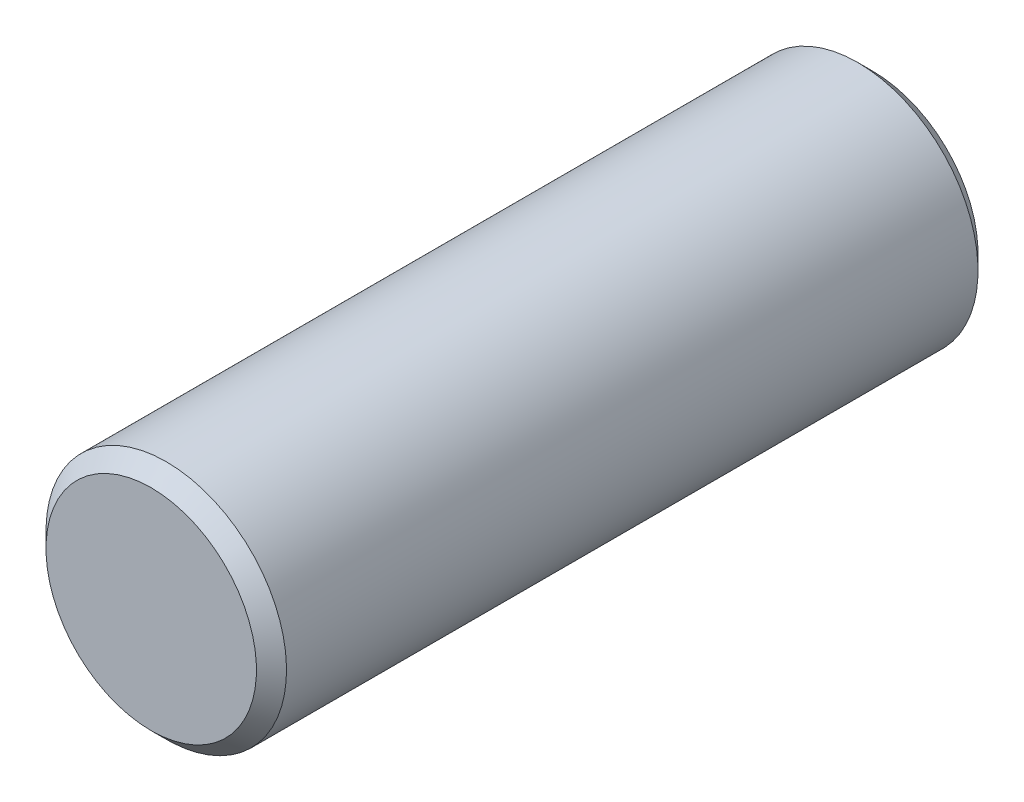
ISO-10303-21;
HEADER;
FILE_DESCRIPTION(('STEP AP214'),'2;1');
FILE_NAME('part.step','',(''),(''),'','','');
FILE_SCHEMA(('AUTOMOTIVE_DESIGN { 1 0 10303 214 1 1 1 1 }'));
ENDSEC;
DATA;
#1=APPLICATION_CONTEXT('core data for automotive mechanical design processes');
#2=APPLICATION_PROTOCOL_DEFINITION('international standard','automotive_design',2000,#1);
#3=PRODUCT_CONTEXT('',#1,'mechanical');
#4=PRODUCT('Part','Part','',(#3));
#5=PRODUCT_RELATED_PRODUCT_CATEGORY('part','',(#4));
#6=PRODUCT_DEFINITION_FORMATION('','',#4);
#7=PRODUCT_DEFINITION_CONTEXT('part definition',#1,'design');
#8=PRODUCT_DEFINITION('design','',#6,#7);
#9=PRODUCT_DEFINITION_SHAPE('','',#8);
#10=(LENGTH_UNIT() NAMED_UNIT(*) SI_UNIT(.MILLI.,.METRE.));
#11=(NAMED_UNIT(*) PLANE_ANGLE_UNIT() SI_UNIT($,.RADIAN.));
#12=(NAMED_UNIT(*) SI_UNIT($,.STERADIAN.) SOLID_ANGLE_UNIT());
#13=UNCERTAINTY_MEASURE_WITH_UNIT(LENGTH_MEASURE(1.E-05),#10,'distance_accuracy_value','');
#14=(GEOMETRIC_REPRESENTATION_CONTEXT(3) GLOBAL_UNCERTAINTY_ASSIGNED_CONTEXT((#13)) GLOBAL_UNIT_ASSIGNED_CONTEXT((#10,
#11,#12)) REPRESENTATION_CONTEXT('',''));
#15=CARTESIAN_POINT('',(0.,0.,0.));
#16=DIRECTION('',(0.,0.,1.));
#17=DIRECTION('',(1.,0.,0.));
#18=AXIS2_PLACEMENT_3D('',#15,#16,#17);
#19=CARTESIAN_POINT('',(0.,0.,5.99999999999999));
#20=DIRECTION('',(0.,0.,1.));
#21=DIRECTION('',(0.,-1.,0.));
#22=AXIS2_PLACEMENT_3D('',#19,#20,#21);
#23=PLANE('',#22);
#24=CARTESIAN_POINT('',(0.,0.,6.00000000002865));
#25=DIRECTION('',(0.,0.,-1.));
#26=DIRECTION('',(0.,1.,0.));
#27=AXIS2_PLACEMENT_3D('',#24,#25,#26);
#28=CIRCLE('',#27,1.74999999995861);
#29=CARTESIAN_POINT('',(0.,1.7499999999586,6.00000000002865));
#30=VERTEX_POINT('',#29);
#31=EDGE_CURVE('E18',#30,#30,#28,.T.);
#32=ORIENTED_EDGE('',*,*,#31,.F.);
#33=EDGE_LOOP('',(#32));
#34=FACE_BOUND('',#33,.T.);
#35=ADVANCED_FACE('F15',(#34),#23,.T.);
#36=CARTESIAN_POINT('',(0.,0.,-5.99999999999998));
#37=DIRECTION('',(0.,0.,1.));
#38=DIRECTION('',(0.,-1.,0.));
#39=AXIS2_PLACEMENT_3D('',#36,#37,#38);
#40=PLANE('',#39);
#41=CARTESIAN_POINT('',(0.,0.,-6.00000000002865));
#42=DIRECTION('',(0.,0.,1.));
#43=DIRECTION('',(0.,-1.,0.));
#44=AXIS2_PLACEMENT_3D('',#41,#42,#43);
#45=CIRCLE('',#44,1.75000000001546);
#46=CARTESIAN_POINT('',(0.,-1.75000000001548,-6.00000000002865));
#47=VERTEX_POINT('',#46);
#48=EDGE_CURVE('E27',#47,#47,#45,.T.);
#49=ORIENTED_EDGE('',*,*,#48,.F.);
#50=EDGE_LOOP('',(#49));
#51=FACE_BOUND('',#50,.T.);
#52=ADVANCED_FACE('F38',(#51),#40,.F.);
#53=CARTESIAN_POINT('',(0.,0.,5.7500000000914));
#54=DIRECTION('',(0.,0.,-1.));
#55=DIRECTION('',(0.,1.,0.));
#56=AXIS2_PLACEMENT_3D('',#53,#54,#55);
#57=CONICAL_SURFACE('',#56,1.99999999989586,0.785398163397448);
#58=CARTESIAN_POINT('',(0.,0.,5.74999999999999));
#59=DIRECTION('',(0.,0.,-1.));
#60=DIRECTION('',(0.,1.,0.));
#61=AXIS2_PLACEMENT_3D('',#58,#59,#60);
#62=CIRCLE('',#61,2.00000000000002);
#63=CARTESIAN_POINT('',(0.,2.,5.74999999999999));
#64=VERTEX_POINT('',#63);
#65=EDGE_CURVE('E22',#64,#64,#62,.T.);
#66=ORIENTED_EDGE('',*,*,#65,.F.);
#67=EDGE_LOOP('',(#66));
#68=FACE_BOUND('',#67,.T.);
#69=ORIENTED_EDGE('',*,*,#31,.T.);
#70=EDGE_LOOP('',(#69));
#71=FACE_BOUND('',#70,.T.);
#72=ADVANCED_FACE('F35',(#68,#71),#57,.T.);
#73=CARTESIAN_POINT('',(0.,0.,-5.7500000000914));
#74=DIRECTION('',(0.,0.,1.));
#75=DIRECTION('',(0.,-1.,0.));
#76=AXIS2_PLACEMENT_3D('',#73,#74,#75);
#77=CONICAL_SURFACE('',#76,1.99999999989586,0.785398163283761);
#78=CARTESIAN_POINT('',(0.,0.,-5.74999999999998));
#79=DIRECTION('',(0.,0.,-1.));
#80=DIRECTION('',(0.,1.,0.));
#81=AXIS2_PLACEMENT_3D('',#78,#79,#80);
#82=CIRCLE('',#81,2.00000000000002);
#83=CARTESIAN_POINT('',(0.,2.,-5.74999999999998));
#84=VERTEX_POINT('',#83);
#85=EDGE_CURVE('E10',#84,#84,#82,.F.);
#86=ORIENTED_EDGE('',*,*,#85,.F.);
#87=EDGE_LOOP('',(#86));
#88=FACE_BOUND('',#87,.T.);
#89=ORIENTED_EDGE('',*,*,#48,.T.);
#90=EDGE_LOOP('',(#89));
#91=FACE_BOUND('',#90,.T.);
#92=ADVANCED_FACE('F46',(#88,#91),#77,.T.);
#93=CARTESIAN_POINT('',(0.,0.,5.99999999999999));
#94=DIRECTION('',(0.,0.,-1.));
#95=DIRECTION('',(0.,1.,0.));
#96=AXIS2_PLACEMENT_3D('',#93,#94,#95);
#97=CYLINDRICAL_SURFACE('',#96,2.00000000000002);
#98=ORIENTED_EDGE('',*,*,#85,.T.);
#99=EDGE_LOOP('',(#98));
#100=FACE_BOUND('',#99,.T.);
#101=ORIENTED_EDGE('',*,*,#65,.T.);
#102=EDGE_LOOP('',(#101));
#103=FACE_BOUND('',#102,.T.);
#104=ADVANCED_FACE('F44',(#100,#103),#97,.T.);
#105=CLOSED_SHELL('',(#35,#52,#72,#92,#104));
#106=MANIFOLD_SOLID_BREP('B1',#105);
#107=ADVANCED_BREP_SHAPE_REPRESENTATION('',(#18,#106),#14);
#108=SHAPE_DEFINITION_REPRESENTATION(#9,#107);
ENDSEC;
END-ISO-10303-21;
